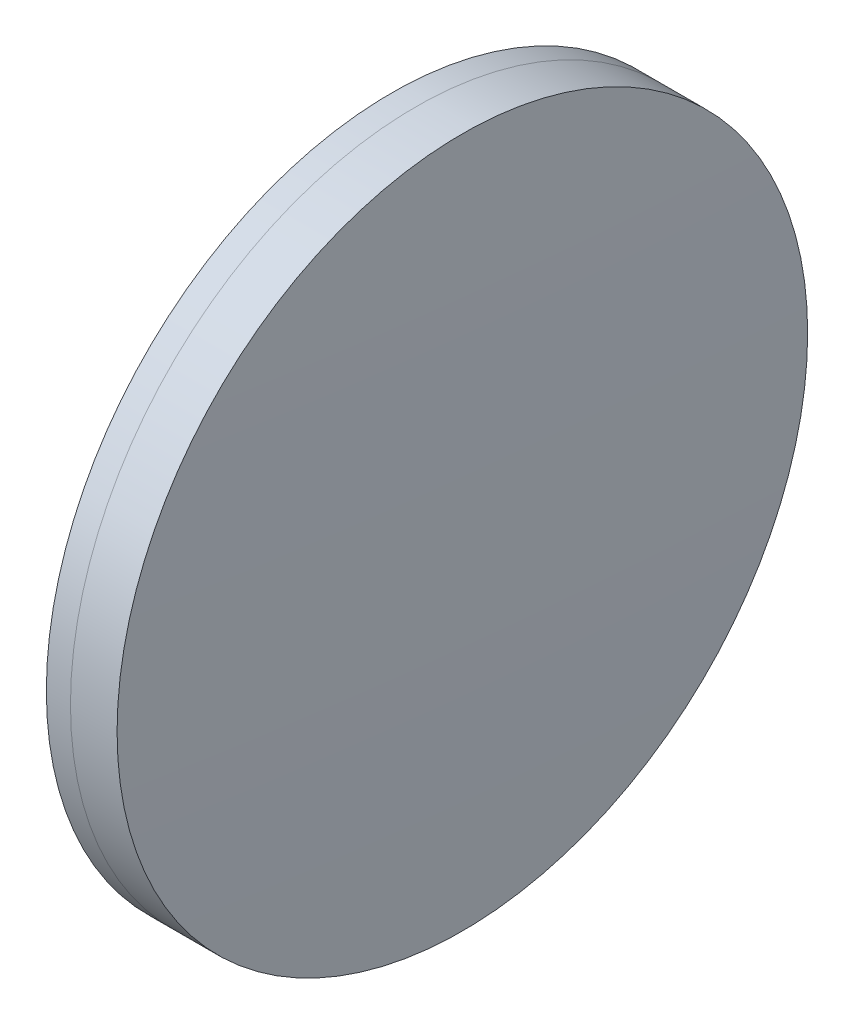
ISO-10303-21;
HEADER;
FILE_DESCRIPTION(('STEP AP214'),'2;1');
FILE_NAME('part.step','',(''),(''),'','','');
FILE_SCHEMA(('AUTOMOTIVE_DESIGN { 1 0 10303 214 1 1 1 1 }'));
ENDSEC;
DATA;
#1=APPLICATION_CONTEXT('core data for automotive mechanical design processes');
#2=APPLICATION_PROTOCOL_DEFINITION('international standard','automotive_design',2000,#1);
#3=PRODUCT_CONTEXT('',#1,'mechanical');
#4=PRODUCT('Part','Part','',(#3));
#5=PRODUCT_RELATED_PRODUCT_CATEGORY('part','',(#4));
#6=PRODUCT_DEFINITION_FORMATION('','',#4);
#7=PRODUCT_DEFINITION_CONTEXT('part definition',#1,'design');
#8=PRODUCT_DEFINITION('design','',#6,#7);
#9=PRODUCT_DEFINITION_SHAPE('','',#8);
#10=(LENGTH_UNIT() NAMED_UNIT(*) SI_UNIT(.MILLI.,.METRE.));
#11=(NAMED_UNIT(*) PLANE_ANGLE_UNIT() SI_UNIT($,.RADIAN.));
#12=(NAMED_UNIT(*) SI_UNIT($,.STERADIAN.) SOLID_ANGLE_UNIT());
#13=UNCERTAINTY_MEASURE_WITH_UNIT(LENGTH_MEASURE(1.E-05),#10,'distance_accuracy_value','');
#14=(GEOMETRIC_REPRESENTATION_CONTEXT(3) GLOBAL_UNCERTAINTY_ASSIGNED_CONTEXT((#13)) GLOBAL_UNIT_ASSIGNED_CONTEXT((#10,
#11,#12)) REPRESENTATION_CONTEXT('',''));
#15=CARTESIAN_POINT('',(0.,0.,0.));
#16=DIRECTION('',(0.,0.,1.));
#17=DIRECTION('',(1.,0.,0.));
#18=AXIS2_PLACEMENT_3D('',#15,#16,#17);
#19=CARTESIAN_POINT('',(39.5551471606919,0.,3.29391632434799E-13));
#20=DIRECTION('',(-1.,0.,0.));
#21=DIRECTION('',(0.,0.,1.));
#22=AXIS2_PLACEMENT_3D('',#19,#20,#21);
#23=SPHERICAL_SURFACE('',#22,255.333);
#24=CARTESIAN_POINT('',(293.661307827843,0.,0.));
#25=DIRECTION('',(-1.,0.,0.));
#26=DIRECTION('',(0.,0.,1.));
#27=AXIS2_PLACEMENT_3D('',#24,#25,#26);
#28=CIRCLE('',#27,24.9999999999998);
#29=CARTESIAN_POINT('',(293.661307827843,0.,24.9999999999998));
#30=VERTEX_POINT('',#29);
#31=EDGE_CURVE('E11',#30,#30,#28,.T.);
#32=ORIENTED_EDGE('',*,*,#31,.T.);
#33=EDGE_LOOP('',(#32));
#34=FACE_BOUND('',#33,.T.);
#35=ADVANCED_FACE('F45',(#34),#23,.F.);
#36=CARTESIAN_POINT('',(-0.551919992657797,0.,0.));
#37=DIRECTION('',(-1.,0.,0.));
#38=DIRECTION('',(0.,0.,1.));
#39=AXIS2_PLACEMENT_3D('',#36,#37,#38);
#40=CYLINDRICAL_SURFACE('',#39,24.9999999999996);
#41=CARTESIAN_POINT('',(297.03634957283,0.,0.));
#42=DIRECTION('',(-1.,0.,0.));
#43=DIRECTION('',(0.,0.,1.));
#44=AXIS2_PLACEMENT_3D('',#41,#42,#43);
#45=CIRCLE('',#44,24.9999999999993);
#46=CARTESIAN_POINT('',(297.03634957283,0.,24.9999999999993));
#47=VERTEX_POINT('',#46);
#48=EDGE_CURVE('E51',#47,#47,#45,.T.);
#49=ORIENTED_EDGE('',*,*,#48,.T.);
#50=EDGE_LOOP('',(#49));
#51=FACE_BOUND('',#50,.T.);
#52=ORIENTED_EDGE('',*,*,#31,.F.);
#53=EDGE_LOOP('',(#52));
#54=FACE_BOUND('',#53,.T.);
#55=ADVANCED_FACE('F57',(#51,#54),#40,.T.);
#56=CARTESIAN_POINT('',(-543.288852839308,0.,0.));
#57=DIRECTION('',(-1.,0.,0.));
#58=DIRECTION('',(0.,0.,1.));
#59=AXIS2_PLACEMENT_3D('',#56,#57,#58);
#60=SPHERICAL_SURFACE('',#59,840.697);
#61=ORIENTED_EDGE('',*,*,#48,.F.);
#62=EDGE_LOOP('',(#61));
#63=FACE_BOUND('',#62,.T.);
#64=ADVANCED_FACE('F60',(#63),#60,.T.);
#65=CLOSED_SHELL('',(#35,#55,#64));
#66=MANIFOLD_SOLID_BREP('B2',#65);
#67=CARTESIAN_POINT('',(678.810147160692,0.,-3.75727079070771E-13));
#68=DIRECTION('',(-1.,0.,0.));
#69=DIRECTION('',(0.,0.,1.));
#70=AXIS2_PLACEMENT_3D('',#67,#68,#69);
#71=SPHERICAL_SURFACE('',#70,387.702);
#72=CARTESIAN_POINT('',(291.915018212291,0.,0.));
#73=DIRECTION('',(-1.,0.,0.));
#74=DIRECTION('',(0.,0.,1.));
#75=AXIS2_PLACEMENT_3D('',#72,#73,#74);
#76=CIRCLE('',#75,25.0000000000001);
#77=CARTESIAN_POINT('',(291.915018212291,0.,25.0000000000001));
#78=VERTEX_POINT('',#77);
#79=EDGE_CURVE('E44',#78,#78,#76,.T.);
#80=ORIENTED_EDGE('',*,*,#79,.T.);
#81=EDGE_LOOP('',(#80));
#82=FACE_BOUND('',#81,.T.);
#83=ADVANCED_FACE('F86',(#82),#71,.T.);
#84=CARTESIAN_POINT('',(124.523309526045,0.,0.));
#85=DIRECTION('',(-1.,0.,0.));
#86=DIRECTION('',(0.,0.,1.));
#87=AXIS2_PLACEMENT_3D('',#84,#85,#86);
#88=CYLINDRICAL_SURFACE('',#87,25.);
#89=CARTESIAN_POINT('',(293.661307827843,0.,0.));
#90=DIRECTION('',(-1.,0.,0.));
#91=DIRECTION('',(0.,0.,1.));
#92=AXIS2_PLACEMENT_3D('',#89,#90,#91);
#93=CIRCLE('',#92,25.);
#94=CARTESIAN_POINT('',(293.661307827843,0.,25.));
#95=VERTEX_POINT('',#94);
#96=EDGE_CURVE('E92',#95,#95,#93,.T.);
#97=ORIENTED_EDGE('',*,*,#96,.T.);
#98=EDGE_LOOP('',(#97));
#99=FACE_BOUND('',#98,.T.);
#100=ORIENTED_EDGE('',*,*,#79,.F.);
#101=EDGE_LOOP('',(#100));
#102=FACE_BOUND('',#101,.T.);
#103=ADVANCED_FACE('F98',(#99,#102),#88,.T.);
#104=CARTESIAN_POINT('',(39.5551471606919,0.,3.29391632434799E-13));
#105=DIRECTION('',(-1.,0.,0.));
#106=DIRECTION('',(0.,0.,1.));
#107=AXIS2_PLACEMENT_3D('',#104,#105,#106);
#108=SPHERICAL_SURFACE('',#107,255.333);
#109=ORIENTED_EDGE('',*,*,#96,.F.);
#110=EDGE_LOOP('',(#109));
#111=FACE_BOUND('',#110,.T.);
#112=ADVANCED_FACE('F101',(#111),#108,.T.);
#113=CLOSED_SHELL('',(#83,#103,#112));
#114=MANIFOLD_SOLID_BREP('B6',#113);
#115=ADVANCED_BREP_SHAPE_REPRESENTATION('',(#18,#66,#114),#14);
#116=SHAPE_DEFINITION_REPRESENTATION(#9,#115);
ENDSEC;
END-ISO-10303-21;
